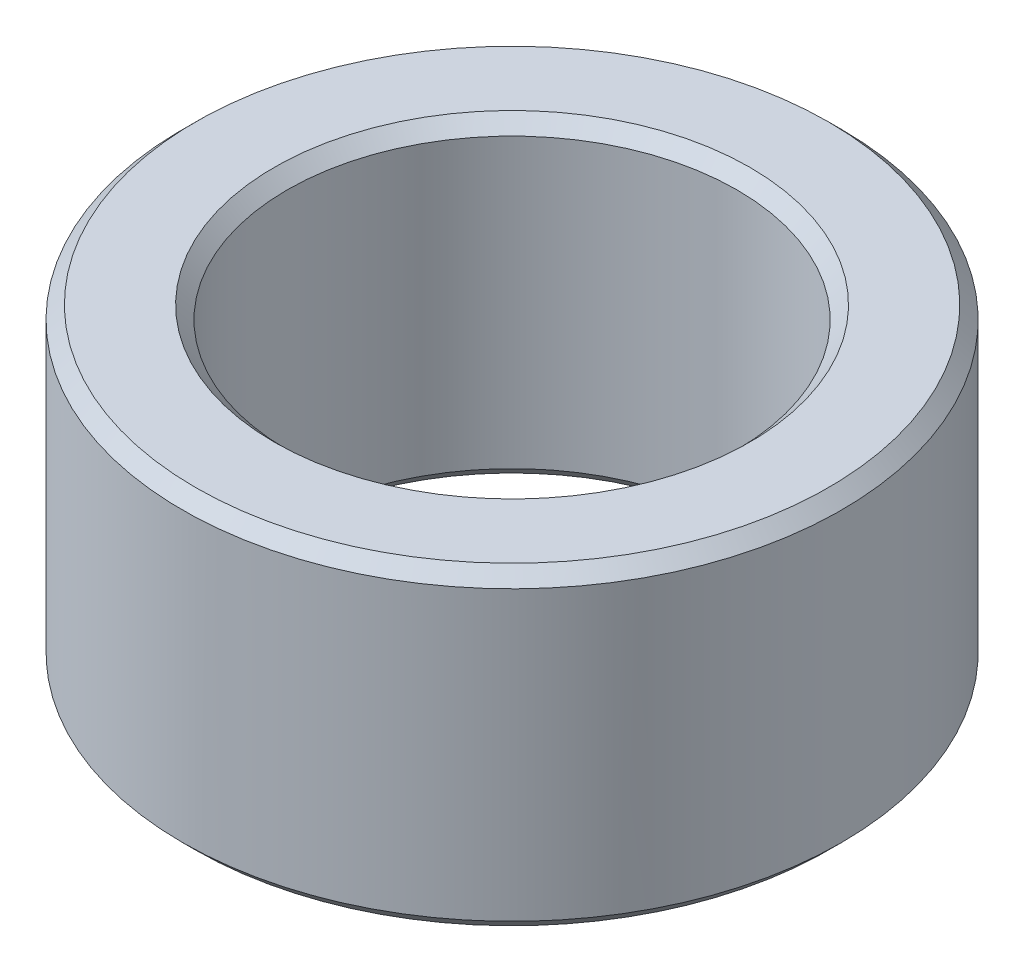
ISO-10303-21;
HEADER;
FILE_DESCRIPTION(('STEP AP214'),'2;1');
FILE_NAME('part.step','',(''),(''),'','','');
FILE_SCHEMA(('AUTOMOTIVE_DESIGN { 1 0 10303 214 1 1 1 1 }'));
ENDSEC;
DATA;
#1=APPLICATION_CONTEXT('core data for automotive mechanical design processes');
#2=APPLICATION_PROTOCOL_DEFINITION('international standard','automotive_design',2000,#1);
#3=PRODUCT_CONTEXT('',#1,'mechanical');
#4=PRODUCT('Part','Part','',(#3));
#5=PRODUCT_RELATED_PRODUCT_CATEGORY('part','',(#4));
#6=PRODUCT_DEFINITION_FORMATION('','',#4);
#7=PRODUCT_DEFINITION_CONTEXT('part definition',#1,'design');
#8=PRODUCT_DEFINITION('design','',#6,#7);
#9=PRODUCT_DEFINITION_SHAPE('','',#8);
#10=(LENGTH_UNIT() NAMED_UNIT(*) SI_UNIT(.MILLI.,.METRE.));
#11=(NAMED_UNIT(*) PLANE_ANGLE_UNIT() SI_UNIT($,.RADIAN.));
#12=(NAMED_UNIT(*) SI_UNIT($,.STERADIAN.) SOLID_ANGLE_UNIT());
#13=UNCERTAINTY_MEASURE_WITH_UNIT(LENGTH_MEASURE(1.E-05),#10,'distance_accuracy_value','');
#14=(GEOMETRIC_REPRESENTATION_CONTEXT(3) GLOBAL_UNCERTAINTY_ASSIGNED_CONTEXT((#13)) GLOBAL_UNIT_ASSIGNED_CONTEXT((#10,
#11,#12)) REPRESENTATION_CONTEXT('',''));
#15=CARTESIAN_POINT('',(0.,0.,0.));
#16=DIRECTION('',(0.,0.,1.));
#17=DIRECTION('',(1.,0.,0.));
#18=AXIS2_PLACEMENT_3D('',#15,#16,#17);
#19=CARTESIAN_POINT('',(0.,33.3425327131978,0.));
#20=DIRECTION('',(0.,-1.,0.));
#21=DIRECTION('',(0.,0.,-1.));
#22=AXIS2_PLACEMENT_3D('',#19,#20,#21);
#23=CYLINDRICAL_SURFACE('',#22,35.);
#24=CARTESIAN_POINT('',(0.,1.37948821822582,0.));
#25=DIRECTION('',(0.,1.,0.));
#26=DIRECTION('',(0.,0.,1.));
#27=AXIS2_PLACEMENT_3D('',#24,#25,#26);
#28=CIRCLE('',#27,35.);
#29=CARTESIAN_POINT('',(0.,1.37948821822582,-35.));
#30=VERTEX_POINT('',#29);
#31=EDGE_CURVE('E10',#30,#30,#28,.T.);
#32=CARTESIAN_POINT('',(0.,31.9630444949719,0.));
#33=DIRECTION('',(0.,1.,0.));
#34=DIRECTION('',(0.,0.,1.));
#35=AXIS2_PLACEMENT_3D('',#32,#33,#34);
#36=CIRCLE('',#35,35.);
#37=CARTESIAN_POINT('',(0.,31.9630444949719,-35.));
#38=VERTEX_POINT('',#37);
#39=EDGE_CURVE('E50',#38,#38,#36,.F.);
#40=CARTESIAN_POINT('',(0.,1.37948821822582,-35.));
#41=CARTESIAN_POINT('',(0.,1.69806692944192,-35.));
#42=CARTESIAN_POINT('',(0.,2.01664564065803,-35.));
#43=CARTESIAN_POINT('',(0.,2.65380306309024,-35.));
#44=CARTESIAN_POINT('',(0.,2.97238177430635,-35.));
#45=CARTESIAN_POINT('',(0.,3.60953919673856,-35.));
#46=CARTESIAN_POINT('',(0.,3.92811790795466,-35.));
#47=CARTESIAN_POINT('',(0.,4.56527533038687,-35.));
#48=CARTESIAN_POINT('',(0.,4.88385404160298,-35.));
#49=CARTESIAN_POINT('',(0.,5.52101146403519,-35.));
#50=CARTESIAN_POINT('',(0.,5.83959017525129,-35.));
#51=CARTESIAN_POINT('',(0.,6.4767475976835,-35.));
#52=CARTESIAN_POINT('',(0.,6.79532630889961,-35.));
#53=CARTESIAN_POINT('',(0.,7.43248373133182,-35.));
#54=CARTESIAN_POINT('',(0.,7.75106244254793,-35.));
#55=CARTESIAN_POINT('',(0.,8.38821986498014,-35.));
#56=CARTESIAN_POINT('',(0.,8.70679857619624,-35.));
#57=CARTESIAN_POINT('',(0.,9.34395599862845,-35.));
#58=CARTESIAN_POINT('',(0.,9.66253470984456,-35.));
#59=CARTESIAN_POINT('',(0.,10.2996921322768,-35.));
#60=CARTESIAN_POINT('',(0.,10.6182708434929,-35.));
#61=CARTESIAN_POINT('',(0.,11.2554282659251,-35.));
#62=CARTESIAN_POINT('',(0.,11.5740069771412,-35.));
#63=CARTESIAN_POINT('',(0.,12.2111643995734,-35.));
#64=CARTESIAN_POINT('',(0.,12.5297431107895,-35.));
#65=CARTESIAN_POINT('',(0.,13.1669005332217,-35.));
#66=CARTESIAN_POINT('',(0.,13.4854792444378,-35.));
#67=CARTESIAN_POINT('',(0.,14.12263666687,-35.));
#68=CARTESIAN_POINT('',(0.,14.4412153780861,-35.));
#69=CARTESIAN_POINT('',(0.,15.0783728005184,-35.));
#70=CARTESIAN_POINT('',(0.,15.3969515117345,-35.));
#71=CARTESIAN_POINT('',(0.,16.0341089341667,-35.));
#72=CARTESIAN_POINT('',(0.,16.3526876453828,-35.));
#73=CARTESIAN_POINT('',(0.,16.989845067815,-35.));
#74=CARTESIAN_POINT('',(0.,17.3084237790311,-35.));
#75=CARTESIAN_POINT('',(0.,17.9455812014633,-35.));
#76=CARTESIAN_POINT('',(0.,18.2641599126794,-35.));
#77=CARTESIAN_POINT('',(0.,18.9013173351116,-35.));
#78=CARTESIAN_POINT('',(0.,19.2198960463277,-35.));
#79=CARTESIAN_POINT('',(0.,19.8570534687599,-35.));
#80=CARTESIAN_POINT('',(0.,20.175632179976,-35.));
#81=CARTESIAN_POINT('',(0.,20.8127896024083,-35.));
#82=CARTESIAN_POINT('',(0.,21.1313683136244,-35.));
#83=CARTESIAN_POINT('',(0.,21.7685257360566,-35.));
#84=CARTESIAN_POINT('',(0.,22.0871044472727,-35.));
#85=CARTESIAN_POINT('',(0.,22.7242618697049,-35.));
#86=CARTESIAN_POINT('',(0.,23.042840580921,-35.));
#87=CARTESIAN_POINT('',(0.,23.6799980033532,-35.));
#88=CARTESIAN_POINT('',(0.,23.9985767145693,-35.));
#89=CARTESIAN_POINT('',(0.,24.6357341370015,-35.));
#90=CARTESIAN_POINT('',(0.,24.9543128482176,-35.));
#91=CARTESIAN_POINT('',(0.,25.5914702706498,-35.));
#92=CARTESIAN_POINT('',(0.,25.9100489818659,-35.));
#93=CARTESIAN_POINT('',(0.,26.5472064042982,-35.));
#94=CARTESIAN_POINT('',(0.,26.8657851155143,-35.));
#95=CARTESIAN_POINT('',(0.,27.5029425379465,-35.));
#96=CARTESIAN_POINT('',(0.,27.8215212491626,-35.));
#97=CARTESIAN_POINT('',(0.,28.4586786715948,-35.));
#98=CARTESIAN_POINT('',(0.,28.7772573828109,-35.));
#99=CARTESIAN_POINT('',(0.,29.4144148052431,-35.));
#100=CARTESIAN_POINT('',(0.,29.7329935164592,-35.));
#101=CARTESIAN_POINT('',(0.,30.3701509388914,-35.));
#102=CARTESIAN_POINT('',(0.,30.6887296501075,-35.));
#103=CARTESIAN_POINT('',(0.,31.3258870725397,-35.));
#104=CARTESIAN_POINT('',(0.,31.6444657837558,-35.));
#105=CARTESIAN_POINT('',(0.,31.9630444949719,-35.));
#106=B_SPLINE_CURVE_WITH_KNOTS('',3,(#40,#41,#42,#43,#44,#45,#46,#47,#48,#49,#50,#51,#52,#53,
#54,#55,#56,#57,#58,#59,#60,#61,#62,#63,#64,#65,#66,#67,#68,#69,#70,#71,#72,#73,#74,#75,#76,#77,
#78,#79,#80,#81,#82,#83,#84,#85,#86,#87,#88,#89,#90,#91,#92,#93,#94,#95,#96,#97,#98,#99,#100,
#101,#102,#103,#104,#105),.UNSPECIFIED.,.F.,.F.,(4,2,2,2,2,2,2,2,2,2,2,2,2,2,2,2,2,2,2,2,2,2,2,
2,2,2,2,2,2,2,2,2,4),(0.,0.955736133648317,1.91147226729663,2.86720840094495,3.82294453459327,
4.77868066824158,5.7344168018899,6.69015293553821,7.64588906918653,8.60162520283485,
9.55736133648317,10.5130974701315,11.4688336037798,12.4245697374281,13.3803058710764,
14.3360420047247,15.2917781383731,16.2475142720214,17.2032504056697,18.158986539318,
19.1147226729663,20.0704588066146,21.026194940263,21.9819310739113,22.9376672075596,
23.8934033412079,24.8491394748562,25.8048756085045,26.7606117421529,27.7163478758012,
28.6720840094495,29.6278201430978,30.5835562767461),.UNSPECIFIED.);
#107=EDGE_CURVE('BSEAM39',#30,#38,#106,.T.);
#108=ORIENTED_EDGE('',*,*,#31,.T.);
#109=ORIENTED_EDGE('',*,*,#39,.T.);
#110=ORIENTED_EDGE('',*,*,#107,.T.);
#111=ORIENTED_EDGE('',*,*,#107,.F.);
#112=EDGE_LOOP('',(#108,#110,#109,#111));
#113=FACE_BOUND('',#112,.T.);
#114=ADVANCED_FACE('F39',(#113),#23,.T.);
#115=CARTESIAN_POINT('',(0.,33.3425327131978,0.));
#116=DIRECTION('',(0.,1.,0.));
#117=DIRECTION('',(0.,0.,1.));
#118=AXIS2_PLACEMENT_3D('',#115,#116,#117);
#119=PLANE('',#118);
#120=CARTESIAN_POINT('',(0.,33.3425327131978,0.));
#121=DIRECTION('',(0.,1.,0.));
#122=DIRECTION('',(0.,0.,1.));
#123=AXIS2_PLACEMENT_3D('',#120,#121,#122);
#124=CIRCLE('',#123,25.267121776353);
#125=CARTESIAN_POINT('',(0.,33.3425327131978,25.267121776353));
#126=VERTEX_POINT('',#125);
#127=EDGE_CURVE('E58',#126,#126,#124,.F.);
#128=ORIENTED_EDGE('',*,*,#127,.T.);
#129=EDGE_LOOP('',(#128));
#130=FACE_BOUND('',#129,.T.);
#131=CARTESIAN_POINT('',(0.,33.3425327131978,0.));
#132=DIRECTION('',(0.,1.,0.));
#133=DIRECTION('',(0.,0.,1.));
#134=AXIS2_PLACEMENT_3D('',#131,#132,#133);
#135=CIRCLE('',#134,33.6205117817742);
#136=CARTESIAN_POINT('',(0.,33.3425327131978,-33.6205117817742));
#137=VERTEX_POINT('',#136);
#138=EDGE_CURVE('E61',#137,#137,#135,.T.);
#139=ORIENTED_EDGE('',*,*,#138,.T.);
#140=EDGE_LOOP('',(#139));
#141=FACE_BOUND('',#140,.T.);
#142=ADVANCED_FACE('F88',(#130,#141),#119,.T.);
#143=CARTESIAN_POINT('',(0.,0.,0.));
#144=DIRECTION('',(0.,1.,0.));
#145=DIRECTION('',(0.,0.,1.));
#146=AXIS2_PLACEMENT_3D('',#143,#144,#145);
#147=PLANE('',#146);
#148=CARTESIAN_POINT('',(0.,0.,0.));
#149=DIRECTION('',(0.,1.,0.));
#150=DIRECTION('',(0.,0.,1.));
#151=AXIS2_PLACEMENT_3D('',#148,#149,#150);
#152=CIRCLE('',#151,25.267121776353);
#153=CARTESIAN_POINT('',(0.,0.,25.267121776353));
#154=VERTEX_POINT('',#153);
#155=EDGE_CURVE('E51',#154,#154,#152,.T.);
#156=ORIENTED_EDGE('',*,*,#155,.T.);
#157=EDGE_LOOP('',(#156));
#158=FACE_BOUND('',#157,.T.);
#159=CARTESIAN_POINT('',(0.,0.,0.));
#160=DIRECTION('',(0.,1.,0.));
#161=DIRECTION('',(0.,0.,1.));
#162=AXIS2_PLACEMENT_3D('',#159,#160,#161);
#163=CIRCLE('',#162,33.6205117817742);
#164=CARTESIAN_POINT('',(0.,0.,33.6205117817742));
#165=VERTEX_POINT('',#164);
#166=EDGE_CURVE('E54',#165,#165,#163,.F.);
#167=ORIENTED_EDGE('',*,*,#166,.T.);
#168=EDGE_LOOP('',(#167));
#169=FACE_BOUND('',#168,.T.);
#170=ADVANCED_FACE('F83',(#158,#169),#147,.F.);
#171=CARTESIAN_POINT('',(0.,33.3425327131978,0.));
#172=DIRECTION('',(0.,-1.,0.));
#173=DIRECTION('',(0.,0.,-1.));
#174=AXIS2_PLACEMENT_3D('',#171,#172,#173);
#175=CYLINDRICAL_SURFACE('',#174,23.8876335581272);
#176=CARTESIAN_POINT('',(0.,31.9630444949719,0.));
#177=DIRECTION('',(0.,1.,0.));
#178=DIRECTION('',(0.,0.,1.));
#179=AXIS2_PLACEMENT_3D('',#176,#177,#178);
#180=CIRCLE('',#179,23.8876335581272);
#181=CARTESIAN_POINT('',(0.,31.9630444949719,23.8876335581272));
#182=VERTEX_POINT('',#181);
#183=EDGE_CURVE('E67',#182,#182,#180,.T.);
#184=ORIENTED_EDGE('',*,*,#183,.T.);
#185=EDGE_LOOP('',(#184));
#186=FACE_BOUND('',#185,.T.);
#187=CARTESIAN_POINT('',(0.,1.37948821822583,0.));
#188=DIRECTION('',(0.,1.,0.));
#189=DIRECTION('',(0.,0.,1.));
#190=AXIS2_PLACEMENT_3D('',#187,#188,#189);
#191=CIRCLE('',#190,23.8876335581272);
#192=CARTESIAN_POINT('',(0.,1.37948821822583,23.8876335581272));
#193=VERTEX_POINT('',#192);
#194=EDGE_CURVE('E69',#193,#193,#191,.F.);
#195=ORIENTED_EDGE('',*,*,#194,.T.);
#196=EDGE_LOOP('',(#195));
#197=FACE_BOUND('',#196,.T.);
#198=ADVANCED_FACE('F71',(#186,#197),#175,.F.);
#199=CARTESIAN_POINT('',(0.,31.9630444949719,0.));
#200=DIRECTION('',(0.,1.,0.));
#201=DIRECTION('',(0.,0.,1.));
#202=AXIS2_PLACEMENT_3D('',#199,#200,#201);
#203=CONICAL_SURFACE('',#202,23.8876335581272,0.785398163397458);
#204=ORIENTED_EDGE('',*,*,#127,.F.);
#205=EDGE_LOOP('',(#204));
#206=FACE_BOUND('',#205,.T.);
#207=ORIENTED_EDGE('',*,*,#183,.F.);
#208=EDGE_LOOP('',(#207));
#209=FACE_BOUND('',#208,.T.);
#210=ADVANCED_FACE('F77',(#206,#209),#203,.F.);
#211=CARTESIAN_POINT('',(0.,0.,0.));
#212=DIRECTION('',(0.,-1.,0.));
#213=DIRECTION('',(0.,0.,-1.));
#214=AXIS2_PLACEMENT_3D('',#211,#212,#213);
#215=CONICAL_SURFACE('',#214,25.267121776353,0.785398163397446);
#216=ORIENTED_EDGE('',*,*,#194,.F.);
#217=EDGE_LOOP('',(#216));
#218=FACE_BOUND('',#217,.T.);
#219=ORIENTED_EDGE('',*,*,#155,.F.);
#220=EDGE_LOOP('',(#219));
#221=FACE_BOUND('',#220,.T.);
#222=ADVANCED_FACE('F73',(#218,#221),#215,.F.);
#223=CARTESIAN_POINT('',(0.,1.37948821822582,0.));
#224=DIRECTION('',(0.,1.,0.));
#225=DIRECTION('',(0.,0.,1.));
#226=AXIS2_PLACEMENT_3D('',#223,#224,#225);
#227=CONICAL_SURFACE('',#226,35.,0.785398163397456);
#228=ORIENTED_EDGE('',*,*,#166,.F.);
#229=EDGE_LOOP('',(#228));
#230=FACE_BOUND('',#229,.T.);
#231=ORIENTED_EDGE('',*,*,#31,.F.);
#232=EDGE_LOOP('',(#231));
#233=FACE_BOUND('',#232,.T.);
#234=ADVANCED_FACE('F76',(#230,#233),#227,.T.);
#235=CARTESIAN_POINT('',(0.,33.3425327131978,0.));
#236=DIRECTION('',(0.,-1.,0.));
#237=DIRECTION('',(0.,0.,-1.));
#238=AXIS2_PLACEMENT_3D('',#235,#236,#237);
#239=CONICAL_SURFACE('',#238,33.6205117817742,0.785398163397443);
#240=CARTESIAN_POINT('',(0.,31.9630444949719,-35.));
#241=CARTESIAN_POINT('',(0.,31.9774141639118,-34.9856303310602));
#242=CARTESIAN_POINT('',(0.,31.9917838328516,-34.9712606621203));
#243=CARTESIAN_POINT('',(0.,32.0205231707314,-34.9425213242406));
#244=CARTESIAN_POINT('',(0.,32.0348928396712,-34.9281516553008));
#245=CARTESIAN_POINT('',(0.,32.0636321775509,-34.899412317421));
#246=CARTESIAN_POINT('',(0.,32.0780018464908,-34.8850426484812));
#247=CARTESIAN_POINT('',(0.,32.1067411843705,-34.8563033106015));
#248=CARTESIAN_POINT('',(0.,32.1211108533103,-34.8419336416616));
#249=CARTESIAN_POINT('',(0.,32.14985019119,-34.8131943037819));
#250=CARTESIAN_POINT('',(0.,32.1642198601299,-34.7988246348421));
#251=CARTESIAN_POINT('',(0.,32.1929591980096,-34.7700852969624));
#252=CARTESIAN_POINT('',(0.,32.2073288669494,-34.7557156280225));
#253=CARTESIAN_POINT('',(0.,32.2360682048291,-34.7269762901428));
#254=CARTESIAN_POINT('',(0.,32.250437873769,-34.712606621203));
#255=CARTESIAN_POINT('',(0.,32.2791772116487,-34.6838672833233));
#256=CARTESIAN_POINT('',(0.,32.2935468805885,-34.6694976143834));
#257=CARTESIAN_POINT('',(0.,32.3222862184683,-34.6407582765037));
#258=CARTESIAN_POINT('',(0.,32.3366558874081,-34.6263886075639));
#259=CARTESIAN_POINT('',(0.,32.3653952252878,-34.5976492696842));
#260=CARTESIAN_POINT('',(0.,32.3797648942277,-34.5832796007443));
#261=CARTESIAN_POINT('',(0.,32.4085042321074,-34.5545402628646));
#262=CARTESIAN_POINT('',(0.,32.4228739010472,-34.5401705939247));
#263=CARTESIAN_POINT('',(0.,32.4516132389269,-34.511431256045));
#264=CARTESIAN_POINT('',(0.,32.4659829078668,-34.4970615871052));
#265=CARTESIAN_POINT('',(0.,32.4947222457465,-34.4683222492255));
#266=CARTESIAN_POINT('',(0.,32.5090919146863,-34.4539525802856));
#267=CARTESIAN_POINT('',(0.,32.537831252566,-34.4252132424059));
#268=CARTESIAN_POINT('',(0.,32.5522009215059,-34.4108435734661));
#269=CARTESIAN_POINT('',(0.,32.5809402593856,-34.3821042355864));
#270=CARTESIAN_POINT('',(0.,32.5953099283254,-34.3677345666465));
#271=CARTESIAN_POINT('',(0.,32.6240492662051,-34.3389952287668));
#272=CARTESIAN_POINT('',(0.,32.638418935145,-34.324625559827));
#273=CARTESIAN_POINT('',(0.,32.6671582730247,-34.2958862219473));
#274=CARTESIAN_POINT('',(0.,32.6815279419646,-34.2815165530074));
#275=CARTESIAN_POINT('',(0.,32.7102672798443,-34.2527772151277));
#276=CARTESIAN_POINT('',(0.,32.7246369487841,-34.2384075461879));
#277=CARTESIAN_POINT('',(0.,32.7533762866638,-34.2096682083081));
#278=CARTESIAN_POINT('',(0.,32.7677459556037,-34.1952985393683));
#279=CARTESIAN_POINT('',(0.,32.7964852934834,-34.1665592014886));
#280=CARTESIAN_POINT('',(0.,32.8108549624232,-34.1521895325487));
#281=CARTESIAN_POINT('',(0.,32.8395943003029,-34.123450194669));
#282=CARTESIAN_POINT('',(0.,32.8539639692428,-34.1090805257292));
#283=CARTESIAN_POINT('',(0.,32.8827033071225,-34.0803411878495));
#284=CARTESIAN_POINT('',(0.,32.8970729760623,-34.0659715189096));
#285=CARTESIAN_POINT('',(0.,32.9258123139421,-34.0372321810299));
#286=CARTESIAN_POINT('',(0.,32.9401819828819,-34.0228625120901));
#287=CARTESIAN_POINT('',(0.,32.9689213207616,-33.9941231742104));
#288=CARTESIAN_POINT('',(0.,32.9832909897015,-33.9797535052705));
#289=CARTESIAN_POINT('',(0.,33.0120303275812,-33.9510141673908));
#290=CARTESIAN_POINT('',(0.,33.026399996521,-33.936644498451));
#291=CARTESIAN_POINT('',(0.,33.0551393344007,-33.9079051605713));
#292=CARTESIAN_POINT('',(0.,33.0695090033406,-33.8935354916314));
#293=CARTESIAN_POINT('',(0.,33.0982483412203,-33.8647961537517));
#294=CARTESIAN_POINT('',(0.,33.1126180101601,-33.8504264848118));
#295=CARTESIAN_POINT('',(0.,33.1413573480398,-33.8216871469321));
#296=CARTESIAN_POINT('',(0.,33.1557270169797,-33.8073174779923));
#297=CARTESIAN_POINT('',(0.,33.1844663548594,-33.7785781401126));
#298=CARTESIAN_POINT('',(0.,33.1988360237992,-33.7642084711727));
#299=CARTESIAN_POINT('',(0.,33.2275753616789,-33.735469133293));
#300=CARTESIAN_POINT('',(0.,33.2419450306188,-33.7210994643532));
#301=CARTESIAN_POINT('',(0.,33.2706843684985,-33.6923601264735));
#302=CARTESIAN_POINT('',(0.,33.2850540374383,-33.6779904575336));
#303=CARTESIAN_POINT('',(0.,33.3137933753181,-33.6492511196539));
#304=CARTESIAN_POINT('',(0.,33.3281630442579,-33.6348814507141));
#305=CARTESIAN_POINT('',(0.,33.3425327131978,-33.6205117817742));
#306=B_SPLINE_CURVE_WITH_KNOTS('',3,(#240,#241,#242,#243,#244,#245,#246,#247,#248,#249,#250,
#251,#252,#253,#254,#255,#256,#257,#258,#259,#260,#261,#262,#263,#264,#265,#266,#267,#268,#269,
#270,#271,#272,#273,#274,#275,#276,#277,#278,#279,#280,#281,#282,#283,#284,#285,#286,#287,#288,
#289,#290,#291,#292,#293,#294,#295,#296,#297,#298,#299,#300,#301,#302,#303,#304,#305),
.UNSPECIFIED.,.F.,.F.,(4,2,2,2,2,2,2,2,2,2,2,2,2,2,2,2,2,2,2,2,2,2,2,2,2,2,2,2,2,2,2,2,4),(0.,
0.0609653421046536,0.121930684209307,0.182896026313961,0.24386136841861,0.304826710523258,
0.365792052627912,0.426757394732561,0.487722736837214,0.548688078941868,0.609653421046516,
0.670618763151165,0.731584105255819,0.792549447360472,0.853514789465121,0.91448013156977,
0.975445473674423,1.03641081577908,1.09737615788373,1.15834149998837,1.21930684209303,
1.28027218419768,1.34123752630233,1.40220286840698,1.46316821051163,1.52413355261628,
1.58509889472094,1.64606423682559,1.70702957893024,1.76799492103489,1.82896026313954,
1.88992560524419,1.95089094734885),.UNSPECIFIED.);
#307=EDGE_CURVE('BSEAM45',#38,#137,#306,.T.);
#308=ORIENTED_EDGE('',*,*,#39,.F.);
#309=ORIENTED_EDGE('',*,*,#138,.F.);
#310=ORIENTED_EDGE('',*,*,#307,.T.);
#311=ORIENTED_EDGE('',*,*,#307,.F.);
#312=EDGE_LOOP('',(#308,#310,#309,#311));
#313=FACE_BOUND('',#312,.T.);
#314=ADVANCED_FACE('F45',(#313),#239,.T.);
#315=CLOSED_SHELL('',(#114,#142,#170,#198,#210,#222,#234,#314));
#316=MANIFOLD_SOLID_BREP('B2',#315);
#317=ADVANCED_BREP_SHAPE_REPRESENTATION('',(#18,#316),#14);
#318=SHAPE_DEFINITION_REPRESENTATION(#9,#317);
ENDSEC;
END-ISO-10303-21;
